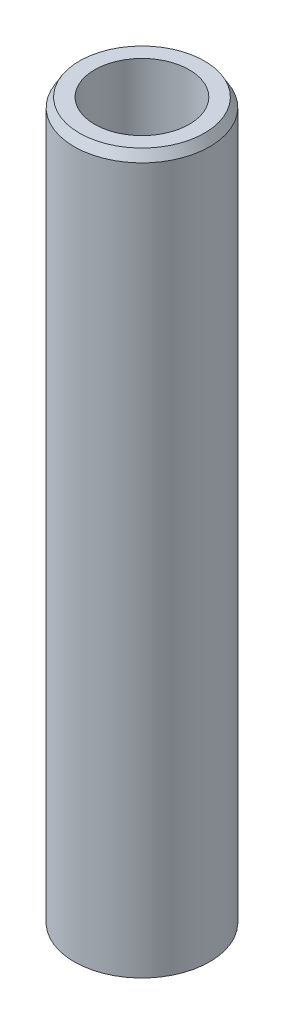
ISO-10303-21;
HEADER;
FILE_DESCRIPTION(('STEP AP214'),'2;1');
FILE_NAME('part.step','',(''),(''),'','','');
FILE_SCHEMA(('AUTOMOTIVE_DESIGN { 1 0 10303 214 1 1 1 1 }'));
ENDSEC;
DATA;
#1=APPLICATION_CONTEXT('core data for automotive mechanical design processes');
#2=APPLICATION_PROTOCOL_DEFINITION('international standard','automotive_design',2000,#1);
#3=PRODUCT_CONTEXT('',#1,'mechanical');
#4=PRODUCT('Part','Part','',(#3));
#5=PRODUCT_RELATED_PRODUCT_CATEGORY('part','',(#4));
#6=PRODUCT_DEFINITION_FORMATION('','',#4);
#7=PRODUCT_DEFINITION_CONTEXT('part definition',#1,'design');
#8=PRODUCT_DEFINITION('design','',#6,#7);
#9=PRODUCT_DEFINITION_SHAPE('','',#8);
#10=(LENGTH_UNIT() NAMED_UNIT(*) SI_UNIT(.MILLI.,.METRE.));
#11=(NAMED_UNIT(*) PLANE_ANGLE_UNIT() SI_UNIT($,.RADIAN.));
#12=(NAMED_UNIT(*) SI_UNIT($,.STERADIAN.) SOLID_ANGLE_UNIT());
#13=UNCERTAINTY_MEASURE_WITH_UNIT(LENGTH_MEASURE(1.E-05),#10,'distance_accuracy_value','');
#14=(GEOMETRIC_REPRESENTATION_CONTEXT(3) GLOBAL_UNCERTAINTY_ASSIGNED_CONTEXT((#13)) GLOBAL_UNIT_ASSIGNED_CONTEXT((#10,
#11,#12)) REPRESENTATION_CONTEXT('',''));
#15=CARTESIAN_POINT('',(0.,0.,0.));
#16=DIRECTION('',(0.,0.,1.));
#17=DIRECTION('',(1.,0.,0.));
#18=AXIS2_PLACEMENT_3D('',#15,#16,#17);
#19=CARTESIAN_POINT('',(0.,398.516272632335,0.));
#20=DIRECTION('',(0.,-1.,0.));
#21=DIRECTION('',(0.,0.,-1.));
#22=AXIS2_PLACEMENT_3D('',#19,#20,#21);
#23=CYLINDRICAL_SURFACE('',#22,37.5);
#24=CARTESIAN_POINT('',(0.,393.470305744819,0.));
#25=DIRECTION('',(0.,1.,0.));
#26=DIRECTION('',(0.,0.,1.));
#27=AXIS2_PLACEMENT_3D('',#24,#25,#26);
#28=CIRCLE('',#27,37.5);
#29=CARTESIAN_POINT('',(0.,393.470305744819,37.5));
#30=VERTEX_POINT('',#29);
#31=EDGE_CURVE('E50',#30,#30,#28,.F.);
#32=ORIENTED_EDGE('',*,*,#31,.T.);
#33=EDGE_LOOP('',(#32));
#34=FACE_BOUND('',#33,.T.);
#35=CARTESIAN_POINT('',(0.,2.91329034082943,0.));
#36=DIRECTION('',(0.,1.,0.));
#37=DIRECTION('',(0.,0.,1.));
#38=AXIS2_PLACEMENT_3D('',#35,#36,#37);
#39=CIRCLE('',#38,37.5);
#40=CARTESIAN_POINT('',(0.,2.91329034082943,37.5));
#41=VERTEX_POINT('',#40);
#42=EDGE_CURVE('E51',#41,#41,#39,.T.);
#43=ORIENTED_EDGE('',*,*,#42,.T.);
#44=EDGE_LOOP('',(#43));
#45=FACE_BOUND('',#44,.T.);
#46=ADVANCED_FACE('F39',(#34,#45),#23,.T.);
#47=CARTESIAN_POINT('',(0.,398.516272632335,0.));
#48=DIRECTION('',(0.,1.,0.));
#49=DIRECTION('',(0.,0.,1.));
#50=AXIS2_PLACEMENT_3D('',#47,#48,#49);
#51=PLANE('',#50);
#52=CARTESIAN_POINT('',(0.,398.516272632335,0.));
#53=DIRECTION('',(0.,1.,0.));
#54=DIRECTION('',(0.,0.,1.));
#55=AXIS2_PLACEMENT_3D('',#52,#53,#54);
#56=CIRCLE('',#55,34.5867096591706);
#57=CARTESIAN_POINT('',(0.,398.516272632335,34.5867096591706));
#58=VERTEX_POINT('',#57);
#59=EDGE_CURVE('E54',#58,#58,#56,.T.);
#60=ORIENTED_EDGE('',*,*,#59,.T.);
#61=EDGE_LOOP('',(#60));
#62=FACE_BOUND('',#61,.T.);
#63=CARTESIAN_POINT('',(0.,398.516272632335,0.));
#64=DIRECTION('',(0.,1.,0.));
#65=DIRECTION('',(0.,0.,1.));
#66=AXIS2_PLACEMENT_3D('',#63,#64,#65);
#67=CIRCLE('',#66,26.1692974797929);
#68=CARTESIAN_POINT('',(0.,398.516272632335,26.1692974797929));
#69=VERTEX_POINT('',#68);
#70=EDGE_CURVE('E58',#69,#69,#67,.T.);
#71=ORIENTED_EDGE('',*,*,#70,.F.);
#72=EDGE_LOOP('',(#71));
#73=FACE_BOUND('',#72,.T.);
#74=ADVANCED_FACE('F69',(#62,#73),#51,.T.);
#75=CARTESIAN_POINT('',(0.,0.,0.));
#76=DIRECTION('',(0.,1.,0.));
#77=DIRECTION('',(0.,0.,1.));
#78=AXIS2_PLACEMENT_3D('',#75,#76,#77);
#79=PLANE('',#78);
#80=CARTESIAN_POINT('',(0.,0.,0.));
#81=DIRECTION('',(0.,1.,0.));
#82=DIRECTION('',(0.,0.,1.));
#83=AXIS2_PLACEMENT_3D('',#80,#81,#82);
#84=CIRCLE('',#83,32.4540331124837);
#85=CARTESIAN_POINT('',(0.,0.,32.4540331124837));
#86=VERTEX_POINT('',#85);
#87=EDGE_CURVE('E10',#86,#86,#84,.F.);
#88=ORIENTED_EDGE('',*,*,#87,.T.);
#89=EDGE_LOOP('',(#88));
#90=FACE_BOUND('',#89,.T.);
#91=CARTESIAN_POINT('',(0.,0.,0.));
#92=DIRECTION('',(0.,1.,0.));
#93=DIRECTION('',(0.,0.,1.));
#94=AXIS2_PLACEMENT_3D('',#91,#92,#93);
#95=CIRCLE('',#94,26.1692974797929);
#96=CARTESIAN_POINT('',(0.,0.,26.1692974797929));
#97=VERTEX_POINT('',#96);
#98=EDGE_CURVE('E63',#97,#97,#95,.T.);
#99=ORIENTED_EDGE('',*,*,#98,.T.);
#100=EDGE_LOOP('',(#99));
#101=FACE_BOUND('',#100,.T.);
#102=ADVANCED_FACE('F75',(#90,#101),#79,.F.);
#103=CARTESIAN_POINT('',(0.,398.516272632335,0.));
#104=DIRECTION('',(0.,-1.,0.));
#105=DIRECTION('',(0.,0.,-1.));
#106=AXIS2_PLACEMENT_3D('',#103,#104,#105);
#107=CYLINDRICAL_SURFACE('',#106,26.1692974797929);
#108=ORIENTED_EDGE('',*,*,#70,.T.);
#109=EDGE_LOOP('',(#108));
#110=FACE_BOUND('',#109,.T.);
#111=ORIENTED_EDGE('',*,*,#98,.F.);
#112=EDGE_LOOP('',(#111));
#113=FACE_BOUND('',#112,.T.);
#114=ADVANCED_FACE('F70',(#110,#113),#107,.F.);
#115=CARTESIAN_POINT('',(0.,398.516272632335,0.));
#116=DIRECTION('',(0.,-1.,0.));
#117=DIRECTION('',(0.,0.,-1.));
#118=AXIS2_PLACEMENT_3D('',#115,#116,#117);
#119=CONICAL_SURFACE('',#118,34.5867096591706,0.523598775598294);
#120=ORIENTED_EDGE('',*,*,#31,.F.);
#121=EDGE_LOOP('',(#120));
#122=FACE_BOUND('',#121,.T.);
#123=ORIENTED_EDGE('',*,*,#59,.F.);
#124=EDGE_LOOP('',(#123));
#125=FACE_BOUND('',#124,.T.);
#126=ADVANCED_FACE('F81',(#122,#125),#119,.T.);
#127=CARTESIAN_POINT('',(0.,2.91329034082943,0.));
#128=DIRECTION('',(0.,1.,0.));
#129=DIRECTION('',(0.,0.,1.));
#130=AXIS2_PLACEMENT_3D('',#127,#128,#129);
#131=CONICAL_SURFACE('',#130,37.5,1.0471975511966);
#132=ORIENTED_EDGE('',*,*,#87,.F.);
#133=EDGE_LOOP('',(#132));
#134=FACE_BOUND('',#133,.T.);
#135=ORIENTED_EDGE('',*,*,#42,.F.);
#136=EDGE_LOOP('',(#135));
#137=FACE_BOUND('',#136,.T.);
#138=ADVANCED_FACE('F45',(#134,#137),#131,.T.);
#139=CLOSED_SHELL('',(#46,#74,#102,#114,#126,#138));
#140=MANIFOLD_SOLID_BREP('B2',#139);
#141=ADVANCED_BREP_SHAPE_REPRESENTATION('',(#18,#140),#14);
#142=SHAPE_DEFINITION_REPRESENTATION(#9,#141);
ENDSEC;
END-ISO-10303-21;
